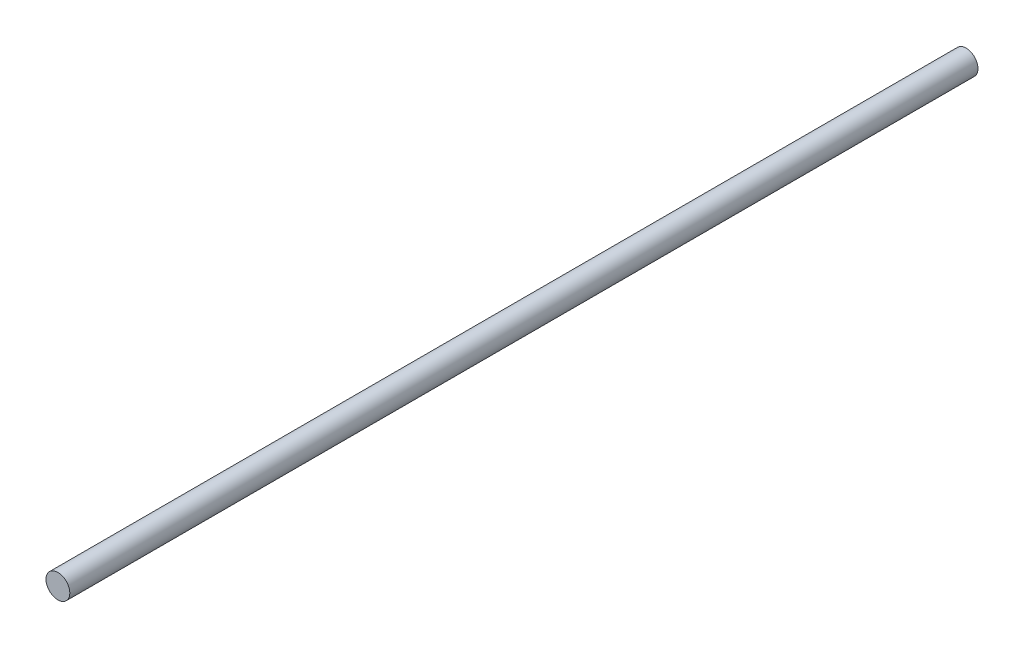
ISO-10303-21;
HEADER;
FILE_DESCRIPTION(('STEP AP214'),'2;1');
FILE_NAME('part.step','',(''),(''),'','','');
FILE_SCHEMA(('AUTOMOTIVE_DESIGN { 1 0 10303 214 1 1 1 1 }'));
ENDSEC;
DATA;
#1=APPLICATION_CONTEXT('core data for automotive mechanical design processes');
#2=APPLICATION_PROTOCOL_DEFINITION('international standard','automotive_design',2000,#1);
#3=PRODUCT_CONTEXT('',#1,'mechanical');
#4=PRODUCT('Part','Part','',(#3));
#5=PRODUCT_RELATED_PRODUCT_CATEGORY('part','',(#4));
#6=PRODUCT_DEFINITION_FORMATION('','',#4);
#7=PRODUCT_DEFINITION_CONTEXT('part definition',#1,'design');
#8=PRODUCT_DEFINITION('design','',#6,#7);
#9=PRODUCT_DEFINITION_SHAPE('','',#8);
#10=(LENGTH_UNIT() NAMED_UNIT(*) SI_UNIT(.MILLI.,.METRE.));
#11=(NAMED_UNIT(*) PLANE_ANGLE_UNIT() SI_UNIT($,.RADIAN.));
#12=(NAMED_UNIT(*) SI_UNIT($,.STERADIAN.) SOLID_ANGLE_UNIT());
#13=UNCERTAINTY_MEASURE_WITH_UNIT(LENGTH_MEASURE(1.E-05),#10,'distance_accuracy_value','');
#14=(GEOMETRIC_REPRESENTATION_CONTEXT(3) GLOBAL_UNCERTAINTY_ASSIGNED_CONTEXT((#13)) GLOBAL_UNIT_ASSIGNED_CONTEXT((#10,
#11,#12)) REPRESENTATION_CONTEXT('',''));
#15=CARTESIAN_POINT('',(0.,0.,0.));
#16=DIRECTION('',(0.,0.,1.));
#17=DIRECTION('',(1.,0.,0.));
#18=AXIS2_PLACEMENT_3D('',#15,#16,#17);
#19=CARTESIAN_POINT('',(-48.8752986194464,81.4071564152755,305.));
#20=DIRECTION('',(0.,0.,-1.));
#21=DIRECTION('',(-1.,0.,0.));
#22=AXIS2_PLACEMENT_3D('',#19,#20,#21);
#23=CYLINDRICAL_SURFACE('',#22,4.);
#24=CARTESIAN_POINT('',(-48.8752986194464,81.4071564152755,305.));
#25=DIRECTION('',(0.,0.,1.));
#26=DIRECTION('',(1.,0.,0.));
#27=AXIS2_PLACEMENT_3D('',#24,#25,#26);
#28=CIRCLE('',#27,4.);
#29=CARTESIAN_POINT('',(-44.8752986194464,81.4071564152755,305.));
#30=VERTEX_POINT('',#29);
#31=EDGE_CURVE('E10',#30,#30,#28,.T.);
#32=ORIENTED_EDGE('',*,*,#31,.F.);
#33=EDGE_LOOP('',(#32));
#34=FACE_BOUND('',#33,.T.);
#35=CARTESIAN_POINT('',(-48.8752986194464,81.4071564152755,0.));
#36=DIRECTION('',(0.,0.,1.));
#37=DIRECTION('',(1.,0.,0.));
#38=AXIS2_PLACEMENT_3D('',#35,#36,#37);
#39=CIRCLE('',#38,4.);
#40=CARTESIAN_POINT('',(-44.8752986194464,81.4071564152755,0.));
#41=VERTEX_POINT('',#40);
#42=EDGE_CURVE('E40',#41,#41,#39,.T.);
#43=ORIENTED_EDGE('',*,*,#42,.T.);
#44=EDGE_LOOP('',(#43));
#45=FACE_BOUND('',#44,.T.);
#46=ADVANCED_FACE('F37',(#34,#45),#23,.T.);
#47=CARTESIAN_POINT('',(-48.8752986194464,81.4071564152755,305.));
#48=DIRECTION('',(0.,0.,1.));
#49=DIRECTION('',(1.,0.,0.));
#50=AXIS2_PLACEMENT_3D('',#47,#48,#49);
#51=PLANE('',#50);
#52=ORIENTED_EDGE('',*,*,#31,.T.);
#53=EDGE_LOOP('',(#52));
#54=FACE_BOUND('',#53,.T.);
#55=ADVANCED_FACE('F54',(#54),#51,.T.);
#56=CARTESIAN_POINT('',(-48.8752986194464,81.4071564152755,0.));
#57=DIRECTION('',(0.,0.,1.));
#58=DIRECTION('',(1.,0.,0.));
#59=AXIS2_PLACEMENT_3D('',#56,#57,#58);
#60=PLANE('',#59);
#61=ORIENTED_EDGE('',*,*,#42,.F.);
#62=EDGE_LOOP('',(#61));
#63=FACE_BOUND('',#62,.T.);
#64=ADVANCED_FACE('F52',(#63),#60,.F.);
#65=CLOSED_SHELL('',(#46,#55,#64));
#66=MANIFOLD_SOLID_BREP('B2',#65);
#67=ADVANCED_BREP_SHAPE_REPRESENTATION('',(#18,#66),#14);
#68=SHAPE_DEFINITION_REPRESENTATION(#9,#67);
ENDSEC;
END-ISO-10303-21;
